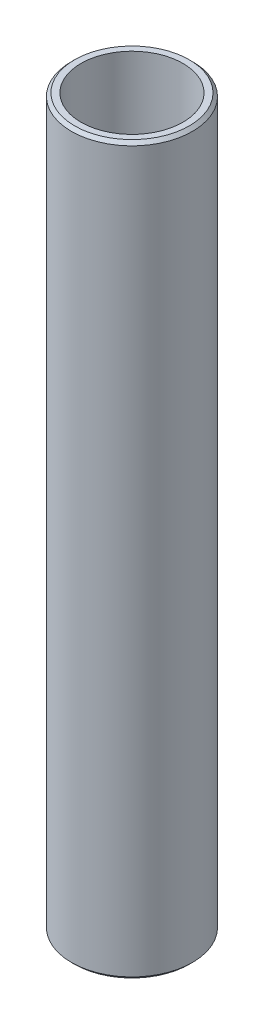
ISO-10303-21;
HEADER;
FILE_DESCRIPTION(('STEP AP214'),'2;1');
FILE_NAME('part.step','',(''),(''),'','','');
FILE_SCHEMA(('AUTOMOTIVE_DESIGN { 1 0 10303 214 1 1 1 1 }'));
ENDSEC;
DATA;
#1=APPLICATION_CONTEXT('core data for automotive mechanical design processes');
#2=APPLICATION_PROTOCOL_DEFINITION('international standard','automotive_design',2000,#1);
#3=PRODUCT_CONTEXT('',#1,'mechanical');
#4=PRODUCT('Part','Part','',(#3));
#5=PRODUCT_RELATED_PRODUCT_CATEGORY('part','',(#4));
#6=PRODUCT_DEFINITION_FORMATION('','',#4);
#7=PRODUCT_DEFINITION_CONTEXT('part definition',#1,'design');
#8=PRODUCT_DEFINITION('design','',#6,#7);
#9=PRODUCT_DEFINITION_SHAPE('','',#8);
#10=(LENGTH_UNIT() NAMED_UNIT(*) SI_UNIT(.MILLI.,.METRE.));
#11=(NAMED_UNIT(*) PLANE_ANGLE_UNIT() SI_UNIT($,.RADIAN.));
#12=(NAMED_UNIT(*) SI_UNIT($,.STERADIAN.) SOLID_ANGLE_UNIT());
#13=UNCERTAINTY_MEASURE_WITH_UNIT(LENGTH_MEASURE(1.E-05),#10,'distance_accuracy_value','');
#14=(GEOMETRIC_REPRESENTATION_CONTEXT(3) GLOBAL_UNCERTAINTY_ASSIGNED_CONTEXT((#13)) GLOBAL_UNIT_ASSIGNED_CONTEXT((#10,
#11,#12)) REPRESENTATION_CONTEXT('',''));
#15=CARTESIAN_POINT('',(0.,0.,0.));
#16=DIRECTION('',(0.,0.,1.));
#17=DIRECTION('',(1.,0.,0.));
#18=AXIS2_PLACEMENT_3D('',#15,#16,#17);
#19=CARTESIAN_POINT('',(0.,600.,0.));
#20=DIRECTION('',(0.,-1.,0.));
#21=DIRECTION('',(0.,0.,-1.));
#22=AXIS2_PLACEMENT_3D('',#19,#20,#21);
#23=CYLINDRICAL_SURFACE('',#22,50.);
#24=CARTESIAN_POINT('',(0.,597.371567327484,0.));
#25=DIRECTION('',(0.,1.,0.));
#26=DIRECTION('',(0.,0.,1.));
#27=AXIS2_PLACEMENT_3D('',#24,#25,#26);
#28=CIRCLE('',#27,50.);
#29=CARTESIAN_POINT('',(0.,597.371567327484,50.));
#30=VERTEX_POINT('',#29);
#31=EDGE_CURVE('E50',#30,#30,#28,.F.);
#32=ORIENTED_EDGE('',*,*,#31,.T.);
#33=EDGE_LOOP('',(#32));
#34=FACE_BOUND('',#33,.T.);
#35=CARTESIAN_POINT('',(0.,2.62843267251545,0.));
#36=DIRECTION('',(0.,1.,0.));
#37=DIRECTION('',(0.,0.,1.));
#38=AXIS2_PLACEMENT_3D('',#35,#36,#37);
#39=CIRCLE('',#38,50.);
#40=CARTESIAN_POINT('',(0.,2.62843267251545,50.));
#41=VERTEX_POINT('',#40);
#42=EDGE_CURVE('E51',#41,#41,#39,.T.);
#43=ORIENTED_EDGE('',*,*,#42,.T.);
#44=EDGE_LOOP('',(#43));
#45=FACE_BOUND('',#44,.T.);
#46=ADVANCED_FACE('F39',(#34,#45),#23,.T.);
#47=CARTESIAN_POINT('',(0.,600.,0.));
#48=DIRECTION('',(0.,1.,0.));
#49=DIRECTION('',(0.,0.,1.));
#50=AXIS2_PLACEMENT_3D('',#47,#48,#49);
#51=PLANE('',#50);
#52=CARTESIAN_POINT('',(0.,600.,0.));
#53=DIRECTION('',(0.,1.,0.));
#54=DIRECTION('',(0.,0.,1.));
#55=AXIS2_PLACEMENT_3D('',#52,#53,#54);
#56=CIRCLE('',#55,47.3715673274845);
#57=CARTESIAN_POINT('',(0.,600.,47.3715673274845));
#58=VERTEX_POINT('',#57);
#59=EDGE_CURVE('E54',#58,#58,#56,.T.);
#60=ORIENTED_EDGE('',*,*,#59,.T.);
#61=EDGE_LOOP('',(#60));
#62=FACE_BOUND('',#61,.T.);
#63=CARTESIAN_POINT('',(0.,600.,0.));
#64=DIRECTION('',(0.,1.,0.));
#65=DIRECTION('',(0.,0.,1.));
#66=AXIS2_PLACEMENT_3D('',#63,#64,#65);
#67=CIRCLE('',#66,42.1362688069569);
#68=CARTESIAN_POINT('',(0.,600.,42.1362688069569));
#69=VERTEX_POINT('',#68);
#70=EDGE_CURVE('E58',#69,#69,#67,.T.);
#71=ORIENTED_EDGE('',*,*,#70,.F.);
#72=EDGE_LOOP('',(#71));
#73=FACE_BOUND('',#72,.T.);
#74=ADVANCED_FACE('F69',(#62,#73),#51,.T.);
#75=CARTESIAN_POINT('',(0.,0.,0.));
#76=DIRECTION('',(0.,1.,0.));
#77=DIRECTION('',(0.,0.,1.));
#78=AXIS2_PLACEMENT_3D('',#75,#76,#77);
#79=PLANE('',#78);
#80=CARTESIAN_POINT('',(0.,0.,0.));
#81=DIRECTION('',(0.,1.,0.));
#82=DIRECTION('',(0.,0.,1.));
#83=AXIS2_PLACEMENT_3D('',#80,#81,#82);
#84=CIRCLE('',#83,47.3715673274845);
#85=CARTESIAN_POINT('',(0.,0.,47.3715673274845));
#86=VERTEX_POINT('',#85);
#87=EDGE_CURVE('E10',#86,#86,#84,.F.);
#88=ORIENTED_EDGE('',*,*,#87,.T.);
#89=EDGE_LOOP('',(#88));
#90=FACE_BOUND('',#89,.T.);
#91=CARTESIAN_POINT('',(0.,0.,0.));
#92=DIRECTION('',(0.,1.,0.));
#93=DIRECTION('',(0.,0.,1.));
#94=AXIS2_PLACEMENT_3D('',#91,#92,#93);
#95=CIRCLE('',#94,42.1362688069569);
#96=CARTESIAN_POINT('',(0.,0.,42.1362688069569));
#97=VERTEX_POINT('',#96);
#98=EDGE_CURVE('E63',#97,#97,#95,.T.);
#99=ORIENTED_EDGE('',*,*,#98,.T.);
#100=EDGE_LOOP('',(#99));
#101=FACE_BOUND('',#100,.T.);
#102=ADVANCED_FACE('F75',(#90,#101),#79,.F.);
#103=CARTESIAN_POINT('',(0.,600.,0.));
#104=DIRECTION('',(0.,-1.,0.));
#105=DIRECTION('',(0.,0.,-1.));
#106=AXIS2_PLACEMENT_3D('',#103,#104,#105);
#107=CYLINDRICAL_SURFACE('',#106,42.1362688069569);
#108=ORIENTED_EDGE('',*,*,#70,.T.);
#109=EDGE_LOOP('',(#108));
#110=FACE_BOUND('',#109,.T.);
#111=ORIENTED_EDGE('',*,*,#98,.F.);
#112=EDGE_LOOP('',(#111));
#113=FACE_BOUND('',#112,.T.);
#114=ADVANCED_FACE('F70',(#110,#113),#107,.F.);
#115=CARTESIAN_POINT('',(0.,600.,0.));
#116=DIRECTION('',(0.,-1.,0.));
#117=DIRECTION('',(0.,0.,-1.));
#118=AXIS2_PLACEMENT_3D('',#115,#116,#117);
#119=CONICAL_SURFACE('',#118,47.3715673274845,0.785398163397442);
#120=ORIENTED_EDGE('',*,*,#31,.F.);
#121=EDGE_LOOP('',(#120));
#122=FACE_BOUND('',#121,.T.);
#123=ORIENTED_EDGE('',*,*,#59,.F.);
#124=EDGE_LOOP('',(#123));
#125=FACE_BOUND('',#124,.T.);
#126=ADVANCED_FACE('F81',(#122,#125),#119,.T.);
#127=CARTESIAN_POINT('',(0.,2.62843267251545,0.));
#128=DIRECTION('',(0.,1.,0.));
#129=DIRECTION('',(0.,0.,1.));
#130=AXIS2_PLACEMENT_3D('',#127,#128,#129);
#131=CONICAL_SURFACE('',#130,50.,0.78539816339745);
#132=ORIENTED_EDGE('',*,*,#87,.F.);
#133=EDGE_LOOP('',(#132));
#134=FACE_BOUND('',#133,.T.);
#135=ORIENTED_EDGE('',*,*,#42,.F.);
#136=EDGE_LOOP('',(#135));
#137=FACE_BOUND('',#136,.T.);
#138=ADVANCED_FACE('F45',(#134,#137),#131,.T.);
#139=CLOSED_SHELL('',(#46,#74,#102,#114,#126,#138));
#140=MANIFOLD_SOLID_BREP('B2',#139);
#141=ADVANCED_BREP_SHAPE_REPRESENTATION('',(#18,#140),#14);
#142=SHAPE_DEFINITION_REPRESENTATION(#9,#141);
ENDSEC;
END-ISO-10303-21;
